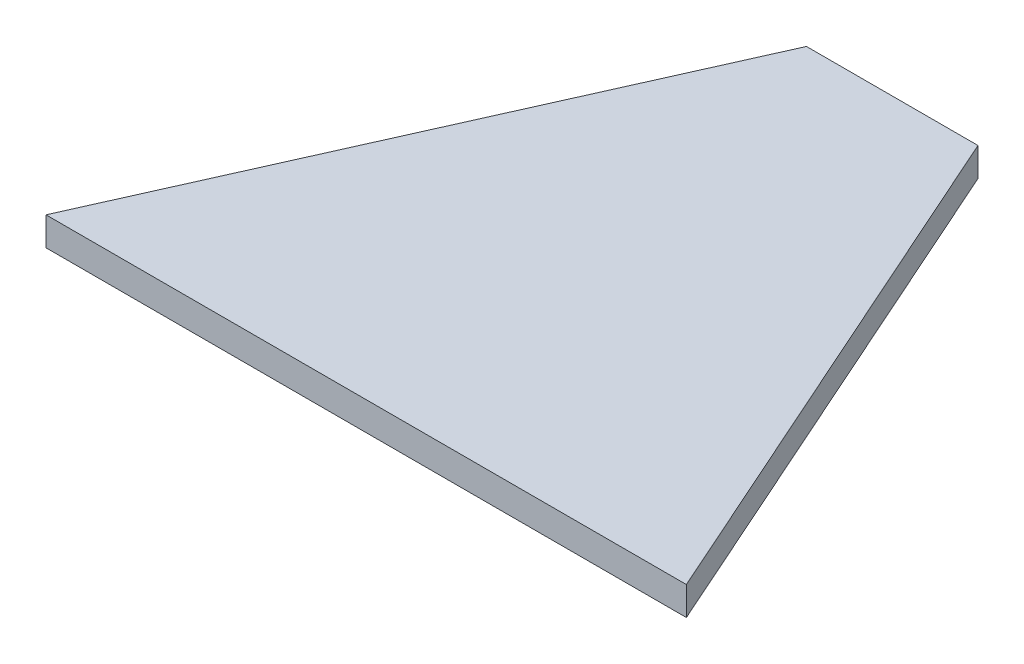
ISO-10303-21;
HEADER;
FILE_DESCRIPTION(('STEP AP214'),'2;1');
FILE_NAME('part.step','',(''),(''),'','','');
FILE_SCHEMA(('AUTOMOTIVE_DESIGN { 1 0 10303 214 1 1 1 1 }'));
ENDSEC;
DATA;
#1=APPLICATION_CONTEXT('core data for automotive mechanical design processes');
#2=APPLICATION_PROTOCOL_DEFINITION('international standard','automotive_design',2000,#1);
#3=PRODUCT_CONTEXT('',#1,'mechanical');
#4=PRODUCT('Part','Part','',(#3));
#5=PRODUCT_RELATED_PRODUCT_CATEGORY('part','',(#4));
#6=PRODUCT_DEFINITION_FORMATION('','',#4);
#7=PRODUCT_DEFINITION_CONTEXT('part definition',#1,'design');
#8=PRODUCT_DEFINITION('design','',#6,#7);
#9=PRODUCT_DEFINITION_SHAPE('','',#8);
#10=(LENGTH_UNIT() NAMED_UNIT(*) SI_UNIT(.MILLI.,.METRE.));
#11=(NAMED_UNIT(*) PLANE_ANGLE_UNIT() SI_UNIT($,.RADIAN.));
#12=(NAMED_UNIT(*) SI_UNIT($,.STERADIAN.) SOLID_ANGLE_UNIT());
#13=UNCERTAINTY_MEASURE_WITH_UNIT(LENGTH_MEASURE(1.E-05),#10,'distance_accuracy_value','');
#14=(GEOMETRIC_REPRESENTATION_CONTEXT(3) GLOBAL_UNCERTAINTY_ASSIGNED_CONTEXT((#13)) GLOBAL_UNIT_ASSIGNED_CONTEXT((#10,
#11,#12)) REPRESENTATION_CONTEXT('',''));
#15=CARTESIAN_POINT('',(0.,0.,0.));
#16=DIRECTION('',(0.,0.,1.));
#17=DIRECTION('',(1.,0.,0.));
#18=AXIS2_PLACEMENT_3D('',#15,#16,#17);
#19=CARTESIAN_POINT('',(-55.9999999999987,5.,0.));
#20=DIRECTION('',(0.913401670747437,0.,0.407059440224387));
#21=DIRECTION('',(0.407059440224387,0.,-0.913401670747437));
#22=AXIS2_PLACEMENT_3D('',#19,#20,#21);
#23=PLANE('',#22);
#24=DIRECTION('',(-0.407059440224387,0.,0.913401670747437));
#25=VECTOR('',#24,1.);
#26=CARTESIAN_POINT('',(-55.9999999999987,0.,0.));
#27=LINE('',#26,#25);
#28=CARTESIAN_POINT('',(-15.0000000000001,0.,-92.));
#29=VERTEX_POINT('',#28);
#30=CARTESIAN_POINT('',(-55.9999999999987,0.,0.));
#31=VERTEX_POINT('',#30);
#32=EDGE_CURVE('E99',#29,#31,#27,.T.);
#33=ORIENTED_EDGE('',*,*,#32,.T.);
#34=DIRECTION('',(0.,-1.,0.));
#35=VECTOR('',#34,1.);
#36=CARTESIAN_POINT('',(-55.9999999999987,5.,0.));
#37=LINE('',#36,#35);
#38=CARTESIAN_POINT('',(-55.9999999999987,5.,0.));
#39=VERTEX_POINT('',#38);
#40=EDGE_CURVE('E11',#39,#31,#37,.T.);
#41=ORIENTED_EDGE('',*,*,#40,.F.);
#42=DIRECTION('',(-0.407059440224387,0.,0.913401670747437));
#43=VECTOR('',#42,1.);
#44=CARTESIAN_POINT('',(-55.9999999999987,5.,0.));
#45=LINE('',#44,#43);
#46=CARTESIAN_POINT('',(-15.0000000000001,5.,-92.));
#47=VERTEX_POINT('',#46);
#48=EDGE_CURVE('E87',#47,#39,#45,.T.);
#49=ORIENTED_EDGE('',*,*,#48,.F.);
#50=DIRECTION('',(0.,-1.,0.));
#51=VECTOR('',#50,1.);
#52=CARTESIAN_POINT('',(-15.0000000000001,5.,-92.));
#53=LINE('',#52,#51);
#54=EDGE_CURVE('E95',#47,#29,#53,.T.);
#55=ORIENTED_EDGE('',*,*,#54,.T.);
#56=EDGE_LOOP('',(#33,#41,#49,#55));
#57=FACE_BOUND('',#56,.T.);
#58=ADVANCED_FACE('F36',(#57),#23,.F.);
#59=CARTESIAN_POINT('',(55.9999999999987,5.,-4.37150315946155E-13));
#60=DIRECTION('',(0.,0.,-1.));
#61=DIRECTION('',(-1.,0.,0.));
#62=AXIS2_PLACEMENT_3D('',#59,#60,#61);
#63=PLANE('',#62);
#64=DIRECTION('',(1.,0.,0.));
#65=VECTOR('',#64,1.);
#66=CARTESIAN_POINT('',(55.9999999999987,0.,-4.37150315946155E-13));
#67=LINE('',#66,#65);
#68=CARTESIAN_POINT('',(55.9999999999987,0.,-4.37150315946155E-13));
#69=VERTEX_POINT('',#68);
#70=EDGE_CURVE('E91',#31,#69,#67,.T.);
#71=ORIENTED_EDGE('',*,*,#70,.T.);
#72=DIRECTION('',(0.,-1.,0.));
#73=VECTOR('',#72,1.);
#74=CARTESIAN_POINT('',(55.9999999999987,5.,-4.37150315946155E-13));
#75=LINE('',#74,#73);
#76=CARTESIAN_POINT('',(55.9999999999987,5.,-4.37150315946155E-13));
#77=VERTEX_POINT('',#76);
#78=EDGE_CURVE('E44',#77,#69,#75,.T.);
#79=ORIENTED_EDGE('',*,*,#78,.F.);
#80=DIRECTION('',(1.,0.,0.));
#81=VECTOR('',#80,1.);
#82=CARTESIAN_POINT('',(55.9999999999987,5.,-4.37150315946155E-13));
#83=LINE('',#82,#81);
#84=EDGE_CURVE('E82',#39,#77,#83,.T.);
#85=ORIENTED_EDGE('',*,*,#84,.F.);
#86=ORIENTED_EDGE('',*,*,#40,.T.);
#87=EDGE_LOOP('',(#71,#79,#85,#86));
#88=FACE_BOUND('',#87,.T.);
#89=ADVANCED_FACE('F90',(#88),#63,.F.);
#90=CARTESIAN_POINT('',(55.9999999999987,5.,-4.37150315946155E-13));
#91=DIRECTION('',(-0.913401670747436,0.,0.407059440224388));
#92=DIRECTION('',(0.407059440224388,0.,0.913401670747436));
#93=AXIS2_PLACEMENT_3D('',#90,#91,#92);
#94=PLANE('',#93);
#95=DIRECTION('',(-0.407059440224388,0.,-0.913401670747436));
#96=VECTOR('',#95,1.);
#97=CARTESIAN_POINT('',(55.9999999999987,0.,-4.37150315946155E-13));
#98=LINE('',#97,#96);
#99=CARTESIAN_POINT('',(15.0000000000001,0.,-92.));
#100=VERTEX_POINT('',#99);
#101=EDGE_CURVE('E69',#69,#100,#98,.T.);
#102=ORIENTED_EDGE('',*,*,#101,.T.);
#103=DIRECTION('',(0.,-1.,0.));
#104=VECTOR('',#103,1.);
#105=CARTESIAN_POINT('',(15.0000000000001,5.,-92.));
#106=LINE('',#105,#104);
#107=CARTESIAN_POINT('',(15.0000000000001,5.,-92.));
#108=VERTEX_POINT('',#107);
#109=EDGE_CURVE('E92',#108,#100,#106,.T.);
#110=ORIENTED_EDGE('',*,*,#109,.F.);
#111=DIRECTION('',(-0.407059440224388,0.,-0.913401670747436));
#112=VECTOR('',#111,1.);
#113=CARTESIAN_POINT('',(55.9999999999987,5.,-4.37150315946155E-13));
#114=LINE('',#113,#112);
#115=EDGE_CURVE('E85',#77,#108,#114,.T.);
#116=ORIENTED_EDGE('',*,*,#115,.F.);
#117=ORIENTED_EDGE('',*,*,#78,.T.);
#118=EDGE_LOOP('',(#102,#110,#116,#117));
#119=FACE_BOUND('',#118,.T.);
#120=ADVANCED_FACE('F93',(#119),#94,.F.);
#121=CARTESIAN_POINT('',(-15.0000000000001,5.,-92.));
#122=DIRECTION('',(0.,0.,1.));
#123=DIRECTION('',(1.,0.,0.));
#124=AXIS2_PLACEMENT_3D('',#121,#122,#123);
#125=PLANE('',#124);
#126=DIRECTION('',(-1.,0.,0.));
#127=VECTOR('',#126,1.);
#128=CARTESIAN_POINT('',(-15.0000000000001,0.,-92.));
#129=LINE('',#128,#127);
#130=EDGE_CURVE('E75',#100,#29,#129,.T.);
#131=ORIENTED_EDGE('',*,*,#130,.T.);
#132=ORIENTED_EDGE('',*,*,#54,.F.);
#133=DIRECTION('',(-1.,0.,0.));
#134=VECTOR('',#133,1.);
#135=CARTESIAN_POINT('',(-15.0000000000001,5.,-92.));
#136=LINE('',#135,#134);
#137=EDGE_CURVE('E52',#108,#47,#136,.T.);
#138=ORIENTED_EDGE('',*,*,#137,.F.);
#139=ORIENTED_EDGE('',*,*,#109,.T.);
#140=EDGE_LOOP('',(#131,#132,#138,#139));
#141=FACE_BOUND('',#140,.T.);
#142=ADVANCED_FACE('F106',(#141),#125,.F.);
#143=CARTESIAN_POINT('',(0.,5.,0.));
#144=DIRECTION('',(0.,-1.,0.));
#145=DIRECTION('',(0.,0.,-1.));
#146=AXIS2_PLACEMENT_3D('',#143,#144,#145);
#147=PLANE('',#146);
#148=ORIENTED_EDGE('',*,*,#48,.T.);
#149=ORIENTED_EDGE('',*,*,#84,.T.);
#150=ORIENTED_EDGE('',*,*,#115,.T.);
#151=ORIENTED_EDGE('',*,*,#137,.T.);
#152=EDGE_LOOP('',(#148,#149,#150,#151));
#153=FACE_BOUND('',#152,.T.);
#154=ADVANCED_FACE('F83',(#153),#147,.F.);
#155=CARTESIAN_POINT('',(0.,0.,0.));
#156=DIRECTION('',(0.,-1.,0.));
#157=DIRECTION('',(0.,0.,-1.));
#158=AXIS2_PLACEMENT_3D('',#155,#156,#157);
#159=PLANE('',#158);
#160=ORIENTED_EDGE('',*,*,#32,.F.);
#161=ORIENTED_EDGE('',*,*,#130,.F.);
#162=ORIENTED_EDGE('',*,*,#101,.F.);
#163=ORIENTED_EDGE('',*,*,#70,.F.);
#164=EDGE_LOOP('',(#160,#161,#162,#163));
#165=FACE_BOUND('',#164,.T.);
#166=ADVANCED_FACE('F109',(#165),#159,.T.);
#167=CLOSED_SHELL('',(#58,#89,#120,#142,#154,#166));
#168=MANIFOLD_SOLID_BREP('B2',#167);
#169=ADVANCED_BREP_SHAPE_REPRESENTATION('',(#18,#168),#14);
#170=SHAPE_DEFINITION_REPRESENTATION(#9,#169);
ENDSEC;
END-ISO-10303-21;
